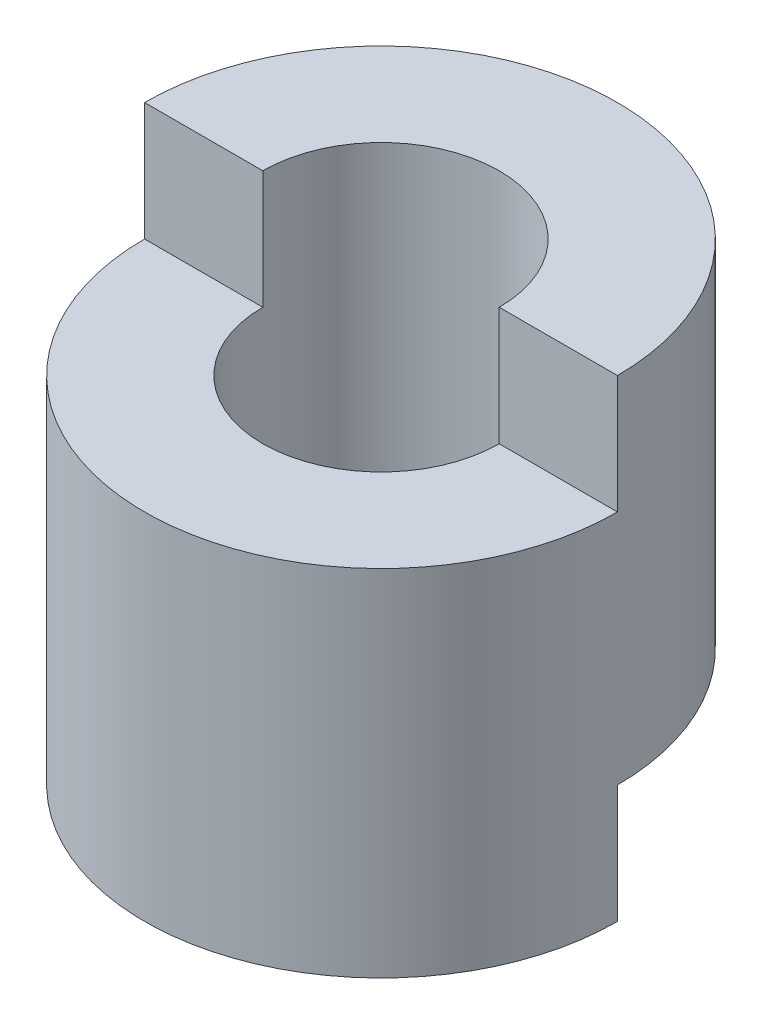
ISO-10303-21;
HEADER;
FILE_DESCRIPTION(('STEP AP214'),'2;1');
FILE_NAME('part.step','',(''),(''),'','','');
FILE_SCHEMA(('AUTOMOTIVE_DESIGN { 1 0 10303 214 1 1 1 1 }'));
ENDSEC;
DATA;
#1=APPLICATION_CONTEXT('core data for automotive mechanical design processes');
#2=APPLICATION_PROTOCOL_DEFINITION('international standard','automotive_design',2000,#1);
#3=PRODUCT_CONTEXT('',#1,'mechanical');
#4=PRODUCT('Part','Part','',(#3));
#5=PRODUCT_RELATED_PRODUCT_CATEGORY('part','',(#4));
#6=PRODUCT_DEFINITION_FORMATION('','',#4);
#7=PRODUCT_DEFINITION_CONTEXT('part definition',#1,'design');
#8=PRODUCT_DEFINITION('design','',#6,#7);
#9=PRODUCT_DEFINITION_SHAPE('','',#8);
#10=(LENGTH_UNIT() NAMED_UNIT(*) SI_UNIT(.MILLI.,.METRE.));
#11=(NAMED_UNIT(*) PLANE_ANGLE_UNIT() SI_UNIT($,.RADIAN.));
#12=(NAMED_UNIT(*) SI_UNIT($,.STERADIAN.) SOLID_ANGLE_UNIT());
#13=UNCERTAINTY_MEASURE_WITH_UNIT(LENGTH_MEASURE(1.E-05),#10,'distance_accuracy_value','');
#14=(GEOMETRIC_REPRESENTATION_CONTEXT(3) GLOBAL_UNCERTAINTY_ASSIGNED_CONTEXT((#13)) GLOBAL_UNIT_ASSIGNED_CONTEXT((#10,
#11,#12)) REPRESENTATION_CONTEXT('',''));
#15=CARTESIAN_POINT('',(0.,0.,0.));
#16=DIRECTION('',(0.,0.,1.));
#17=DIRECTION('',(1.,0.,0.));
#18=AXIS2_PLACEMENT_3D('',#15,#16,#17);
#19=CARTESIAN_POINT('',(0.,20.,0.));
#20=DIRECTION('',(0.,1.,0.));
#21=DIRECTION('',(-1.,0.,0.));
#22=AXIS2_PLACEMENT_3D('',#19,#20,#21);
#23=PLANE('',#22);
#24=DIRECTION('',(-1.,0.,0.));
#25=VECTOR('',#24,1.);
#26=CARTESIAN_POINT('',(-10.,20.,0.));
#27=LINE('',#26,#25);
#28=CARTESIAN_POINT('',(-5.,20.,0.));
#29=VERTEX_POINT('',#28);
#30=CARTESIAN_POINT('',(-10.,20.,0.));
#31=VERTEX_POINT('',#30);
#32=EDGE_CURVE('E126',#29,#31,#27,.T.);
#33=ORIENTED_EDGE('',*,*,#32,.F.);
#34=CARTESIAN_POINT('',(0.,20.,0.));
#35=DIRECTION('',(0.,1.,0.));
#36=DIRECTION('',(-1.,0.,0.));
#37=AXIS2_PLACEMENT_3D('',#34,#35,#36);
#38=CIRCLE('',#37,5.);
#39=CARTESIAN_POINT('',(5.,20.,0.));
#40=VERTEX_POINT('',#39);
#41=EDGE_CURVE('E141',#40,#29,#38,.T.);
#42=ORIENTED_EDGE('',*,*,#41,.F.);
#43=DIRECTION('',(-1.,0.,0.));
#44=VECTOR('',#43,1.);
#45=CARTESIAN_POINT('',(5.,20.,0.));
#46=LINE('',#45,#44);
#47=CARTESIAN_POINT('',(10.,20.,0.));
#48=VERTEX_POINT('',#47);
#49=EDGE_CURVE('E134',#48,#40,#46,.T.);
#50=ORIENTED_EDGE('',*,*,#49,.F.);
#51=CARTESIAN_POINT('',(0.,20.,0.));
#52=DIRECTION('',(0.,-1.,0.));
#53=DIRECTION('',(1.,0.,0.));
#54=AXIS2_PLACEMENT_3D('',#51,#52,#53);
#55=CIRCLE('',#54,10.);
#56=EDGE_CURVE('E11',#31,#48,#55,.T.);
#57=ORIENTED_EDGE('',*,*,#56,.F.);
#58=EDGE_LOOP('',(#33,#42,#50,#57));
#59=FACE_BOUND('',#58,.T.);
#60=ADVANCED_FACE('F33',(#59),#23,.T.);
#61=CARTESIAN_POINT('',(0.,0.,0.));
#62=DIRECTION('',(0.,-1.,0.));
#63=DIRECTION('',(1.,0.,0.));
#64=AXIS2_PLACEMENT_3D('',#61,#62,#63);
#65=CYLINDRICAL_SURFACE('',#64,10.);
#66=DIRECTION('',(0.,-1.,0.));
#67=VECTOR('',#66,1.);
#68=CARTESIAN_POINT('',(-10.,5.,0.));
#69=LINE('',#68,#67);
#70=CARTESIAN_POINT('',(-10.,5.,0.));
#71=VERTEX_POINT('',#70);
#72=CARTESIAN_POINT('',(-10.,0.,0.));
#73=VERTEX_POINT('',#72);
#74=EDGE_CURVE('E136',#71,#73,#69,.T.);
#75=ORIENTED_EDGE('',*,*,#74,.T.);
#76=CARTESIAN_POINT('',(0.,0.,0.));
#77=DIRECTION('',(0.,-1.,0.));
#78=DIRECTION('',(1.,0.,0.));
#79=AXIS2_PLACEMENT_3D('',#76,#77,#78);
#80=CIRCLE('',#79,10.);
#81=CARTESIAN_POINT('',(10.,0.,0.));
#82=VERTEX_POINT('',#81);
#83=EDGE_CURVE('E40',#82,#73,#80,.T.);
#84=ORIENTED_EDGE('',*,*,#83,.F.);
#85=DIRECTION('',(0.,-1.,0.));
#86=VECTOR('',#85,1.);
#87=CARTESIAN_POINT('',(10.,5.,0.));
#88=LINE('',#87,#86);
#89=CARTESIAN_POINT('',(10.,5.,0.));
#90=VERTEX_POINT('',#89);
#91=EDGE_CURVE('E97',#90,#82,#88,.T.);
#92=ORIENTED_EDGE('',*,*,#91,.F.);
#93=CARTESIAN_POINT('',(0.,5.,0.));
#94=DIRECTION('',(0.,-1.,0.));
#95=DIRECTION('',(1.,0.,0.));
#96=AXIS2_PLACEMENT_3D('',#93,#94,#95);
#97=CIRCLE('',#96,10.);
#98=EDGE_CURVE('E103',#71,#90,#97,.T.);
#99=ORIENTED_EDGE('',*,*,#98,.F.);
#100=EDGE_LOOP('',(#75,#84,#92,#99));
#101=FACE_BOUND('',#100,.T.);
#102=DIRECTION('',(0.,1.,0.));
#103=VECTOR('',#102,1.);
#104=CARTESIAN_POINT('',(-10.,15.,0.));
#105=LINE('',#104,#103);
#106=CARTESIAN_POINT('',(-10.,15.,0.));
#107=VERTEX_POINT('',#106);
#108=EDGE_CURVE('E138',#107,#31,#105,.T.);
#109=ORIENTED_EDGE('',*,*,#108,.T.);
#110=ORIENTED_EDGE('',*,*,#56,.T.);
#111=DIRECTION('',(0.,1.,0.));
#112=VECTOR('',#111,1.);
#113=CARTESIAN_POINT('',(10.,15.,0.));
#114=LINE('',#113,#112);
#115=CARTESIAN_POINT('',(10.,15.,0.));
#116=VERTEX_POINT('',#115);
#117=EDGE_CURVE('E133',#116,#48,#114,.T.);
#118=ORIENTED_EDGE('',*,*,#117,.F.);
#119=CARTESIAN_POINT('',(0.,15.,0.));
#120=DIRECTION('',(0.,1.,0.));
#121=DIRECTION('',(-1.,0.,0.));
#122=AXIS2_PLACEMENT_3D('',#119,#120,#121);
#123=CIRCLE('',#122,10.);
#124=EDGE_CURVE('E124',#107,#116,#123,.T.);
#125=ORIENTED_EDGE('',*,*,#124,.F.);
#126=EDGE_LOOP('',(#109,#110,#118,#125));
#127=FACE_BOUND('',#126,.T.);
#128=ADVANCED_FACE('F115',(#101,#127),#65,.T.);
#129=CARTESIAN_POINT('',(0.,0.,0.));
#130=DIRECTION('',(0.,-1.,0.));
#131=DIRECTION('',(1.,0.,0.));
#132=AXIS2_PLACEMENT_3D('',#129,#130,#131);
#133=PLANE('',#132);
#134=DIRECTION('',(-1.,0.,0.));
#135=VECTOR('',#134,1.);
#136=CARTESIAN_POINT('',(-10.,0.,0.));
#137=LINE('',#136,#135);
#138=CARTESIAN_POINT('',(-5.,0.,0.));
#139=VERTEX_POINT('',#138);
#140=EDGE_CURVE('E112',#139,#73,#137,.T.);
#141=ORIENTED_EDGE('',*,*,#140,.F.);
#142=CARTESIAN_POINT('',(0.,0.,0.));
#143=DIRECTION('',(0.,1.,0.));
#144=DIRECTION('',(-1.,0.,0.));
#145=AXIS2_PLACEMENT_3D('',#142,#143,#144);
#146=CIRCLE('',#145,5.);
#147=CARTESIAN_POINT('',(5.,0.,0.));
#148=VERTEX_POINT('',#147);
#149=EDGE_CURVE('E148',#139,#148,#146,.T.);
#150=ORIENTED_EDGE('',*,*,#149,.T.);
#151=DIRECTION('',(-1.,0.,0.));
#152=VECTOR('',#151,1.);
#153=CARTESIAN_POINT('',(5.,0.,0.));
#154=LINE('',#153,#152);
#155=EDGE_CURVE('E156',#82,#148,#154,.T.);
#156=ORIENTED_EDGE('',*,*,#155,.F.);
#157=ORIENTED_EDGE('',*,*,#83,.T.);
#158=EDGE_LOOP('',(#141,#150,#156,#157));
#159=FACE_BOUND('',#158,.T.);
#160=ADVANCED_FACE('F154',(#159),#133,.T.);
#161=CARTESIAN_POINT('',(0.,0.,0.));
#162=DIRECTION('',(0.,1.,0.));
#163=DIRECTION('',(-1.,0.,0.));
#164=AXIS2_PLACEMENT_3D('',#161,#162,#163);
#165=CYLINDRICAL_SURFACE('',#164,5.);
#166=ORIENTED_EDGE('',*,*,#149,.F.);
#167=DIRECTION('',(0.,-1.,0.));
#168=VECTOR('',#167,1.);
#169=CARTESIAN_POINT('',(-5.,5.,0.));
#170=LINE('',#169,#168);
#171=CARTESIAN_POINT('',(-5.,5.,0.));
#172=VERTEX_POINT('',#171);
#173=EDGE_CURVE('E119',#172,#139,#170,.T.);
#174=ORIENTED_EDGE('',*,*,#173,.F.);
#175=CARTESIAN_POINT('',(0.,5.,0.));
#176=DIRECTION('',(0.,1.,0.));
#177=DIRECTION('',(1.,0.,0.));
#178=AXIS2_PLACEMENT_3D('',#175,#176,#177);
#179=CIRCLE('',#178,5.);
#180=CARTESIAN_POINT('',(5.,5.,0.));
#181=VERTEX_POINT('',#180);
#182=EDGE_CURVE('E102',#181,#172,#179,.T.);
#183=ORIENTED_EDGE('',*,*,#182,.F.);
#184=DIRECTION('',(0.,-1.,0.));
#185=VECTOR('',#184,1.);
#186=CARTESIAN_POINT('',(5.,5.,0.));
#187=LINE('',#186,#185);
#188=EDGE_CURVE('E100',#181,#148,#187,.T.);
#189=ORIENTED_EDGE('',*,*,#188,.T.);
#190=EDGE_LOOP('',(#166,#174,#183,#189));
#191=FACE_BOUND('',#190,.T.);
#192=ORIENTED_EDGE('',*,*,#41,.T.);
#193=DIRECTION('',(0.,1.,0.));
#194=VECTOR('',#193,1.);
#195=CARTESIAN_POINT('',(-5.,15.,0.));
#196=LINE('',#195,#194);
#197=CARTESIAN_POINT('',(-5.,15.,0.));
#198=VERTEX_POINT('',#197);
#199=EDGE_CURVE('E142',#198,#29,#196,.T.);
#200=ORIENTED_EDGE('',*,*,#199,.F.);
#201=CARTESIAN_POINT('',(0.,15.,0.));
#202=DIRECTION('',(0.,-1.,0.));
#203=DIRECTION('',(-1.,0.,0.));
#204=AXIS2_PLACEMENT_3D('',#201,#202,#203);
#205=CIRCLE('',#204,5.);
#206=CARTESIAN_POINT('',(5.,15.,0.));
#207=VERTEX_POINT('',#206);
#208=EDGE_CURVE('E128',#207,#198,#205,.T.);
#209=ORIENTED_EDGE('',*,*,#208,.F.);
#210=DIRECTION('',(0.,1.,0.));
#211=VECTOR('',#210,1.);
#212=CARTESIAN_POINT('',(5.,15.,0.));
#213=LINE('',#212,#211);
#214=EDGE_CURVE('E144',#207,#40,#213,.T.);
#215=ORIENTED_EDGE('',*,*,#214,.T.);
#216=EDGE_LOOP('',(#192,#200,#209,#215));
#217=FACE_BOUND('',#216,.T.);
#218=ADVANCED_FACE('F165',(#191,#217),#165,.F.);
#219=CARTESIAN_POINT('',(-10.,15.,0.));
#220=DIRECTION('',(0.,0.,-1.));
#221=DIRECTION('',(-1.,0.,0.));
#222=AXIS2_PLACEMENT_3D('',#219,#220,#221);
#223=PLANE('',#222);
#224=ORIENTED_EDGE('',*,*,#32,.T.);
#225=ORIENTED_EDGE('',*,*,#108,.F.);
#226=DIRECTION('',(-1.,0.,0.));
#227=VECTOR('',#226,1.);
#228=CARTESIAN_POINT('',(-10.,15.,0.));
#229=LINE('',#228,#227);
#230=EDGE_CURVE('E130',#198,#107,#229,.T.);
#231=ORIENTED_EDGE('',*,*,#230,.F.);
#232=ORIENTED_EDGE('',*,*,#199,.T.);
#233=EDGE_LOOP('',(#224,#225,#231,#232));
#234=FACE_BOUND('',#233,.T.);
#235=ADVANCED_FACE('F168',(#234),#223,.F.);
#236=CARTESIAN_POINT('',(5.,15.,0.));
#237=DIRECTION('',(0.,0.,-1.));
#238=DIRECTION('',(-1.,0.,0.));
#239=AXIS2_PLACEMENT_3D('',#236,#237,#238);
#240=PLANE('',#239);
#241=ORIENTED_EDGE('',*,*,#49,.T.);
#242=ORIENTED_EDGE('',*,*,#214,.F.);
#243=DIRECTION('',(-1.,0.,0.));
#244=VECTOR('',#243,1.);
#245=CARTESIAN_POINT('',(5.,15.,0.));
#246=LINE('',#245,#244);
#247=EDGE_CURVE('E55',#116,#207,#246,.T.);
#248=ORIENTED_EDGE('',*,*,#247,.F.);
#249=ORIENTED_EDGE('',*,*,#117,.T.);
#250=EDGE_LOOP('',(#241,#242,#248,#249));
#251=FACE_BOUND('',#250,.T.);
#252=ADVANCED_FACE('F183',(#251),#240,.F.);
#253=CARTESIAN_POINT('',(0.,15.,0.));
#254=DIRECTION('',(0.,1.,0.));
#255=DIRECTION('',(-1.,0.,0.));
#256=AXIS2_PLACEMENT_3D('',#253,#254,#255);
#257=PLANE('',#256);
#258=ORIENTED_EDGE('',*,*,#124,.T.);
#259=ORIENTED_EDGE('',*,*,#247,.T.);
#260=ORIENTED_EDGE('',*,*,#208,.T.);
#261=ORIENTED_EDGE('',*,*,#230,.T.);
#262=EDGE_LOOP('',(#258,#259,#260,#261));
#263=FACE_BOUND('',#262,.T.);
#264=ADVANCED_FACE('F181',(#263),#257,.T.);
#265=CARTESIAN_POINT('',(-10.,5.,0.));
#266=DIRECTION('',(0.,0.,1.));
#267=DIRECTION('',(1.,0.,0.));
#268=AXIS2_PLACEMENT_3D('',#265,#266,#267);
#269=PLANE('',#268);
#270=ORIENTED_EDGE('',*,*,#140,.T.);
#271=ORIENTED_EDGE('',*,*,#74,.F.);
#272=DIRECTION('',(-1.,0.,0.));
#273=VECTOR('',#272,1.);
#274=CARTESIAN_POINT('',(-10.,5.,0.));
#275=LINE('',#274,#273);
#276=EDGE_CURVE('E109',#172,#71,#275,.T.);
#277=ORIENTED_EDGE('',*,*,#276,.F.);
#278=ORIENTED_EDGE('',*,*,#173,.T.);
#279=EDGE_LOOP('',(#270,#271,#277,#278));
#280=FACE_BOUND('',#279,.T.);
#281=ADVANCED_FACE('F163',(#280),#269,.F.);
#282=CARTESIAN_POINT('',(5.,5.,0.));
#283=DIRECTION('',(0.,0.,1.));
#284=DIRECTION('',(1.,0.,0.));
#285=AXIS2_PLACEMENT_3D('',#282,#283,#284);
#286=PLANE('',#285);
#287=ORIENTED_EDGE('',*,*,#155,.T.);
#288=ORIENTED_EDGE('',*,*,#188,.F.);
#289=DIRECTION('',(-1.,0.,0.));
#290=VECTOR('',#289,1.);
#291=CARTESIAN_POINT('',(5.,5.,0.));
#292=LINE('',#291,#290);
#293=EDGE_CURVE('E47',#90,#181,#292,.T.);
#294=ORIENTED_EDGE('',*,*,#293,.F.);
#295=ORIENTED_EDGE('',*,*,#91,.T.);
#296=EDGE_LOOP('',(#287,#288,#294,#295));
#297=FACE_BOUND('',#296,.T.);
#298=ADVANCED_FACE('F95',(#297),#286,.F.);
#299=CARTESIAN_POINT('',(0.,5.,0.));
#300=DIRECTION('',(0.,-1.,0.));
#301=DIRECTION('',(1.,0.,0.));
#302=AXIS2_PLACEMENT_3D('',#299,#300,#301);
#303=PLANE('',#302);
#304=ORIENTED_EDGE('',*,*,#98,.T.);
#305=ORIENTED_EDGE('',*,*,#293,.T.);
#306=ORIENTED_EDGE('',*,*,#182,.T.);
#307=ORIENTED_EDGE('',*,*,#276,.T.);
#308=EDGE_LOOP('',(#304,#305,#306,#307));
#309=FACE_BOUND('',#308,.T.);
#310=ADVANCED_FACE('F107',(#309),#303,.T.);
#311=CLOSED_SHELL('',(#60,#128,#160,#218,#235,#252,#264,#281,#298,#310));
#312=MANIFOLD_SOLID_BREP('B2',#311);
#313=ADVANCED_BREP_SHAPE_REPRESENTATION('',(#18,#312),#14);
#314=SHAPE_DEFINITION_REPRESENTATION(#9,#313);
ENDSEC;
END-ISO-10303-21;
